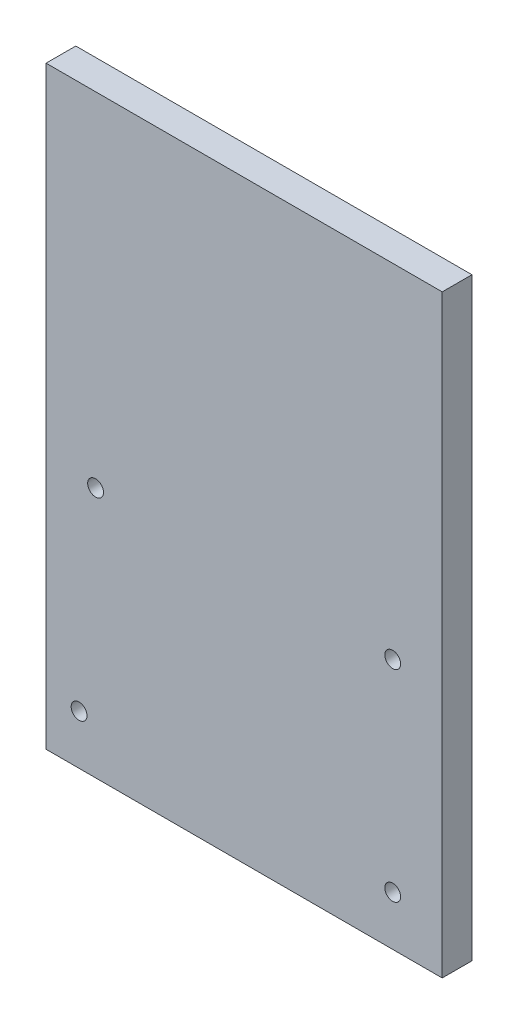
ISO-10303-21;
HEADER;
FILE_DESCRIPTION(('STEP AP214'),'2;1');
FILE_NAME('part.step','',(''),(''),'','','');
FILE_SCHEMA(('AUTOMOTIVE_DESIGN { 1 0 10303 214 1 1 1 1 }'));
ENDSEC;
DATA;
#1=APPLICATION_CONTEXT('core data for automotive mechanical design processes');
#2=APPLICATION_PROTOCOL_DEFINITION('international standard','automotive_design',2000,#1);
#3=PRODUCT_CONTEXT('',#1,'mechanical');
#4=PRODUCT('Part','Part','',(#3));
#5=PRODUCT_RELATED_PRODUCT_CATEGORY('part','',(#4));
#6=PRODUCT_DEFINITION_FORMATION('','',#4);
#7=PRODUCT_DEFINITION_CONTEXT('part definition',#1,'design');
#8=PRODUCT_DEFINITION('design','',#6,#7);
#9=PRODUCT_DEFINITION_SHAPE('','',#8);
#10=(LENGTH_UNIT() NAMED_UNIT(*) SI_UNIT(.MILLI.,.METRE.));
#11=(NAMED_UNIT(*) PLANE_ANGLE_UNIT() SI_UNIT($,.RADIAN.));
#12=(NAMED_UNIT(*) SI_UNIT($,.STERADIAN.) SOLID_ANGLE_UNIT());
#13=UNCERTAINTY_MEASURE_WITH_UNIT(LENGTH_MEASURE(1.E-05),#10,'distance_accuracy_value','');
#14=(GEOMETRIC_REPRESENTATION_CONTEXT(3) GLOBAL_UNCERTAINTY_ASSIGNED_CONTEXT((#13)) GLOBAL_UNIT_ASSIGNED_CONTEXT((#10,
#11,#12)) REPRESENTATION_CONTEXT('',''));
#15=CARTESIAN_POINT('',(0.,0.,0.));
#16=DIRECTION('',(0.,0.,1.));
#17=DIRECTION('',(1.,0.,0.));
#18=AXIS2_PLACEMENT_3D('',#15,#16,#17);
#19=CARTESIAN_POINT('',(0.,0.,15.));
#20=DIRECTION('',(0.,0.,-1.));
#21=DIRECTION('',(-1.,0.,0.));
#22=AXIS2_PLACEMENT_3D('',#19,#20,#21);
#23=PLANE('',#22);
#24=DIRECTION('',(0.,1.,0.));
#25=VECTOR('',#24,1.);
#26=CARTESIAN_POINT('',(100.,-150.,15.));
#27=LINE('',#26,#25);
#28=CARTESIAN_POINT('',(100.,-150.,15.));
#29=VERTEX_POINT('',#28);
#30=CARTESIAN_POINT('',(100.,150.,15.));
#31=VERTEX_POINT('',#30);
#32=EDGE_CURVE('E84',#29,#31,#27,.T.);
#33=ORIENTED_EDGE('',*,*,#32,.T.);
#34=DIRECTION('',(-1.,0.,0.));
#35=VECTOR('',#34,1.);
#36=CARTESIAN_POINT('',(-100.,150.,15.));
#37=LINE('',#36,#35);
#38=CARTESIAN_POINT('',(-100.,150.,15.));
#39=VERTEX_POINT('',#38);
#40=EDGE_CURVE('E79',#31,#39,#37,.T.);
#41=ORIENTED_EDGE('',*,*,#40,.T.);
#42=DIRECTION('',(0.,-1.,0.));
#43=VECTOR('',#42,1.);
#44=CARTESIAN_POINT('',(-100.,-150.,15.));
#45=LINE('',#44,#43);
#46=CARTESIAN_POINT('',(-100.,-150.,15.));
#47=VERTEX_POINT('',#46);
#48=EDGE_CURVE('E82',#39,#47,#45,.T.);
#49=ORIENTED_EDGE('',*,*,#48,.T.);
#50=DIRECTION('',(1.,0.,0.));
#51=VECTOR('',#50,1.);
#52=CARTESIAN_POINT('',(-100.,-150.,15.));
#53=LINE('',#52,#51);
#54=EDGE_CURVE('E49',#47,#29,#53,.T.);
#55=ORIENTED_EDGE('',*,*,#54,.T.);
#56=EDGE_LOOP('',(#33,#41,#49,#55));
#57=FACE_BOUND('',#56,.T.);
#58=CARTESIAN_POINT('',(-75.005,-23.2,15.));
#59=DIRECTION('',(0.,0.,1.));
#60=DIRECTION('',(1.,0.,0.));
#61=AXIS2_PLACEMENT_3D('',#58,#59,#60);
#62=CIRCLE('',#61,4.00000000000001);
#63=CARTESIAN_POINT('',(-71.005,-23.2,15.));
#64=VERTEX_POINT('',#63);
#65=EDGE_CURVE('E99',#64,#64,#62,.T.);
#66=ORIENTED_EDGE('',*,*,#65,.F.);
#67=EDGE_LOOP('',(#66));
#68=FACE_BOUND('',#67,.T.);
#69=CARTESIAN_POINT('',(75.005,-23.2,15.));
#70=DIRECTION('',(0.,0.,1.));
#71=DIRECTION('',(1.,0.,0.));
#72=AXIS2_PLACEMENT_3D('',#69,#70,#71);
#73=CIRCLE('',#72,4.00000000000001);
#74=CARTESIAN_POINT('',(79.005,-23.2,15.));
#75=VERTEX_POINT('',#74);
#76=EDGE_CURVE('E114',#75,#75,#73,.T.);
#77=ORIENTED_EDGE('',*,*,#76,.F.);
#78=EDGE_LOOP('',(#77));
#79=FACE_BOUND('',#78,.T.);
#80=CARTESIAN_POINT('',(75.005,-125.,15.));
#81=DIRECTION('',(0.,0.,1.));
#82=DIRECTION('',(1.,0.,0.));
#83=AXIS2_PLACEMENT_3D('',#80,#81,#82);
#84=CIRCLE('',#83,4.00000000000001);
#85=CARTESIAN_POINT('',(79.0050000000001,-125.,15.));
#86=VERTEX_POINT('',#85);
#87=EDGE_CURVE('E120',#86,#86,#84,.T.);
#88=ORIENTED_EDGE('',*,*,#87,.F.);
#89=EDGE_LOOP('',(#88));
#90=FACE_BOUND('',#89,.T.);
#91=CARTESIAN_POINT('',(-83.3333333333334,-125.,15.));
#92=DIRECTION('',(0.,0.,1.));
#93=DIRECTION('',(1.,0.,0.));
#94=AXIS2_PLACEMENT_3D('',#91,#92,#93);
#95=CIRCLE('',#94,4.00000000000001);
#96=CARTESIAN_POINT('',(-79.3333333333334,-125.,15.));
#97=VERTEX_POINT('',#96);
#98=EDGE_CURVE('E126',#97,#97,#95,.T.);
#99=ORIENTED_EDGE('',*,*,#98,.F.);
#100=EDGE_LOOP('',(#99));
#101=FACE_BOUND('',#100,.T.);
#102=ADVANCED_FACE('F32',(#57,#68,#79,#90,#101),#23,.F.);
#103=CARTESIAN_POINT('',(0.,0.,0.));
#104=DIRECTION('',(0.,0.,-1.));
#105=DIRECTION('',(-1.,0.,0.));
#106=AXIS2_PLACEMENT_3D('',#103,#104,#105);
#107=PLANE('',#106);
#108=CARTESIAN_POINT('',(75.005,-125.,0.));
#109=DIRECTION('',(0.,0.,1.));
#110=DIRECTION('',(1.,0.,0.));
#111=AXIS2_PLACEMENT_3D('',#108,#109,#110);
#112=CIRCLE('',#111,4.00000000000001);
#113=CARTESIAN_POINT('',(79.0050000000001,-125.,0.));
#114=VERTEX_POINT('',#113);
#115=EDGE_CURVE('E123',#114,#114,#112,.T.);
#116=ORIENTED_EDGE('',*,*,#115,.T.);
#117=EDGE_LOOP('',(#116));
#118=FACE_BOUND('',#117,.T.);
#119=CARTESIAN_POINT('',(-75.005,-23.2,0.));
#120=DIRECTION('',(0.,0.,1.));
#121=DIRECTION('',(1.,0.,0.));
#122=AXIS2_PLACEMENT_3D('',#119,#120,#121);
#123=CIRCLE('',#122,4.00000000000001);
#124=CARTESIAN_POINT('',(-71.005,-23.2,0.));
#125=VERTEX_POINT('',#124);
#126=EDGE_CURVE('E111',#125,#125,#123,.T.);
#127=ORIENTED_EDGE('',*,*,#126,.T.);
#128=EDGE_LOOP('',(#127));
#129=FACE_BOUND('',#128,.T.);
#130=DIRECTION('',(0.,1.,0.));
#131=VECTOR('',#130,1.);
#132=CARTESIAN_POINT('',(100.,-150.,0.));
#133=LINE('',#132,#131);
#134=CARTESIAN_POINT('',(100.,-150.,0.));
#135=VERTEX_POINT('',#134);
#136=CARTESIAN_POINT('',(100.,150.,0.));
#137=VERTEX_POINT('',#136);
#138=EDGE_CURVE('E96',#135,#137,#133,.T.);
#139=ORIENTED_EDGE('',*,*,#138,.F.);
#140=DIRECTION('',(1.,0.,0.));
#141=VECTOR('',#140,1.);
#142=CARTESIAN_POINT('',(-100.,-150.,0.));
#143=LINE('',#142,#141);
#144=CARTESIAN_POINT('',(-100.,-150.,0.));
#145=VERTEX_POINT('',#144);
#146=EDGE_CURVE('E72',#145,#135,#143,.T.);
#147=ORIENTED_EDGE('',*,*,#146,.F.);
#148=DIRECTION('',(0.,-1.,0.));
#149=VECTOR('',#148,1.);
#150=CARTESIAN_POINT('',(-100.,-150.,0.));
#151=LINE('',#150,#149);
#152=CARTESIAN_POINT('',(-100.,150.,0.));
#153=VERTEX_POINT('',#152);
#154=EDGE_CURVE('E66',#153,#145,#151,.T.);
#155=ORIENTED_EDGE('',*,*,#154,.F.);
#156=DIRECTION('',(-1.,0.,0.));
#157=VECTOR('',#156,1.);
#158=CARTESIAN_POINT('',(-100.,150.,0.));
#159=LINE('',#158,#157);
#160=EDGE_CURVE('E88',#137,#153,#159,.T.);
#161=ORIENTED_EDGE('',*,*,#160,.F.);
#162=EDGE_LOOP('',(#139,#147,#155,#161));
#163=FACE_BOUND('',#162,.T.);
#164=CARTESIAN_POINT('',(75.005,-23.2,0.));
#165=DIRECTION('',(0.,0.,1.));
#166=DIRECTION('',(1.,0.,0.));
#167=AXIS2_PLACEMENT_3D('',#164,#165,#166);
#168=CIRCLE('',#167,4.00000000000001);
#169=CARTESIAN_POINT('',(79.005,-23.2,0.));
#170=VERTEX_POINT('',#169);
#171=EDGE_CURVE('E117',#170,#170,#168,.T.);
#172=ORIENTED_EDGE('',*,*,#171,.T.);
#173=EDGE_LOOP('',(#172));
#174=FACE_BOUND('',#173,.T.);
#175=CARTESIAN_POINT('',(-83.3333333333334,-125.,0.));
#176=DIRECTION('',(0.,0.,1.));
#177=DIRECTION('',(1.,0.,0.));
#178=AXIS2_PLACEMENT_3D('',#175,#176,#177);
#179=CIRCLE('',#178,4.00000000000001);
#180=CARTESIAN_POINT('',(-79.3333333333334,-125.,0.));
#181=VERTEX_POINT('',#180);
#182=EDGE_CURVE('E129',#181,#181,#179,.T.);
#183=ORIENTED_EDGE('',*,*,#182,.T.);
#184=EDGE_LOOP('',(#183));
#185=FACE_BOUND('',#184,.T.);
#186=ADVANCED_FACE('F107',(#118,#129,#163,#174,#185),#107,.T.);
#187=CARTESIAN_POINT('',(100.,-150.,15.));
#188=DIRECTION('',(-1.,0.,0.));
#189=DIRECTION('',(0.,0.,1.));
#190=AXIS2_PLACEMENT_3D('',#187,#188,#189);
#191=PLANE('',#190);
#192=ORIENTED_EDGE('',*,*,#138,.T.);
#193=DIRECTION('',(0.,0.,-1.));
#194=VECTOR('',#193,1.);
#195=CARTESIAN_POINT('',(100.,150.,15.));
#196=LINE('',#195,#194);
#197=EDGE_CURVE('E11',#31,#137,#196,.T.);
#198=ORIENTED_EDGE('',*,*,#197,.F.);
#199=ORIENTED_EDGE('',*,*,#32,.F.);
#200=DIRECTION('',(0.,0.,-1.));
#201=VECTOR('',#200,1.);
#202=CARTESIAN_POINT('',(100.,-150.,15.));
#203=LINE('',#202,#201);
#204=EDGE_CURVE('E92',#29,#135,#203,.T.);
#205=ORIENTED_EDGE('',*,*,#204,.T.);
#206=EDGE_LOOP('',(#192,#198,#199,#205));
#207=FACE_BOUND('',#206,.T.);
#208=ADVANCED_FACE('F34',(#207),#191,.F.);
#209=CARTESIAN_POINT('',(-100.,150.,15.));
#210=DIRECTION('',(0.,-1.,0.));
#211=DIRECTION('',(0.,0.,-1.));
#212=AXIS2_PLACEMENT_3D('',#209,#210,#211);
#213=PLANE('',#212);
#214=ORIENTED_EDGE('',*,*,#160,.T.);
#215=DIRECTION('',(0.,0.,-1.));
#216=VECTOR('',#215,1.);
#217=CARTESIAN_POINT('',(-100.,150.,15.));
#218=LINE('',#217,#216);
#219=EDGE_CURVE('E41',#39,#153,#218,.T.);
#220=ORIENTED_EDGE('',*,*,#219,.F.);
#221=ORIENTED_EDGE('',*,*,#40,.F.);
#222=ORIENTED_EDGE('',*,*,#197,.T.);
#223=EDGE_LOOP('',(#214,#220,#221,#222));
#224=FACE_BOUND('',#223,.T.);
#225=ADVANCED_FACE('F87',(#224),#213,.F.);
#226=CARTESIAN_POINT('',(-100.,-150.,15.));
#227=DIRECTION('',(1.,0.,0.));
#228=DIRECTION('',(0.,0.,-1.));
#229=AXIS2_PLACEMENT_3D('',#226,#227,#228);
#230=PLANE('',#229);
#231=ORIENTED_EDGE('',*,*,#154,.T.);
#232=DIRECTION('',(0.,0.,-1.));
#233=VECTOR('',#232,1.);
#234=CARTESIAN_POINT('',(-100.,-150.,15.));
#235=LINE('',#234,#233);
#236=EDGE_CURVE('E89',#47,#145,#235,.T.);
#237=ORIENTED_EDGE('',*,*,#236,.F.);
#238=ORIENTED_EDGE('',*,*,#48,.F.);
#239=ORIENTED_EDGE('',*,*,#219,.T.);
#240=EDGE_LOOP('',(#231,#237,#238,#239));
#241=FACE_BOUND('',#240,.T.);
#242=ADVANCED_FACE('F90',(#241),#230,.F.);
#243=CARTESIAN_POINT('',(-100.,-150.,15.));
#244=DIRECTION('',(0.,1.,0.));
#245=DIRECTION('',(0.,0.,1.));
#246=AXIS2_PLACEMENT_3D('',#243,#244,#245);
#247=PLANE('',#246);
#248=ORIENTED_EDGE('',*,*,#146,.T.);
#249=ORIENTED_EDGE('',*,*,#204,.F.);
#250=ORIENTED_EDGE('',*,*,#54,.F.);
#251=ORIENTED_EDGE('',*,*,#236,.T.);
#252=EDGE_LOOP('',(#248,#249,#250,#251));
#253=FACE_BOUND('',#252,.T.);
#254=ADVANCED_FACE('F104',(#253),#247,.F.);
#255=CARTESIAN_POINT('',(-75.005,-23.2,15.));
#256=DIRECTION('',(0.,0.,-1.));
#257=DIRECTION('',(-1.,0.,0.));
#258=AXIS2_PLACEMENT_3D('',#255,#256,#257);
#259=CYLINDRICAL_SURFACE('',#258,4.00000000000001);
#260=ORIENTED_EDGE('',*,*,#65,.T.);
#261=EDGE_LOOP('',(#260));
#262=FACE_BOUND('',#261,.T.);
#263=ORIENTED_EDGE('',*,*,#126,.F.);
#264=EDGE_LOOP('',(#263));
#265=FACE_BOUND('',#264,.T.);
#266=ADVANCED_FACE('F146',(#262,#265),#259,.F.);
#267=CARTESIAN_POINT('',(75.005,-23.2,15.));
#268=DIRECTION('',(0.,0.,-1.));
#269=DIRECTION('',(-1.,0.,0.));
#270=AXIS2_PLACEMENT_3D('',#267,#268,#269);
#271=CYLINDRICAL_SURFACE('',#270,4.00000000000001);
#272=ORIENTED_EDGE('',*,*,#76,.T.);
#273=EDGE_LOOP('',(#272));
#274=FACE_BOUND('',#273,.T.);
#275=ORIENTED_EDGE('',*,*,#171,.F.);
#276=EDGE_LOOP('',(#275));
#277=FACE_BOUND('',#276,.T.);
#278=ADVANCED_FACE('F192',(#274,#277),#271,.F.);
#279=CARTESIAN_POINT('',(75.005,-125.,15.));
#280=DIRECTION('',(0.,0.,-1.));
#281=DIRECTION('',(-1.,0.,0.));
#282=AXIS2_PLACEMENT_3D('',#279,#280,#281);
#283=CYLINDRICAL_SURFACE('',#282,4.00000000000001);
#284=ORIENTED_EDGE('',*,*,#87,.T.);
#285=EDGE_LOOP('',(#284));
#286=FACE_BOUND('',#285,.T.);
#287=ORIENTED_EDGE('',*,*,#115,.F.);
#288=EDGE_LOOP('',(#287));
#289=FACE_BOUND('',#288,.T.);
#290=ADVANCED_FACE('F200',(#286,#289),#283,.F.);
#291=CARTESIAN_POINT('',(-83.3333333333334,-125.,15.));
#292=DIRECTION('',(0.,0.,-1.));
#293=DIRECTION('',(-1.,0.,0.));
#294=AXIS2_PLACEMENT_3D('',#291,#292,#293);
#295=CYLINDRICAL_SURFACE('',#294,4.00000000000001);
#296=ORIENTED_EDGE('',*,*,#98,.T.);
#297=EDGE_LOOP('',(#296));
#298=FACE_BOUND('',#297,.T.);
#299=ORIENTED_EDGE('',*,*,#182,.F.);
#300=EDGE_LOOP('',(#299));
#301=FACE_BOUND('',#300,.T.);
#302=ADVANCED_FACE('F135',(#298,#301),#295,.F.);
#303=CLOSED_SHELL('',(#102,#186,#208,#225,#242,#254,#266,#278,#290,#302));
#304=MANIFOLD_SOLID_BREP('B2',#303);
#305=ADVANCED_BREP_SHAPE_REPRESENTATION('',(#18,#304),#14);
#306=SHAPE_DEFINITION_REPRESENTATION(#9,#305);
ENDSEC;
END-ISO-10303-21;
